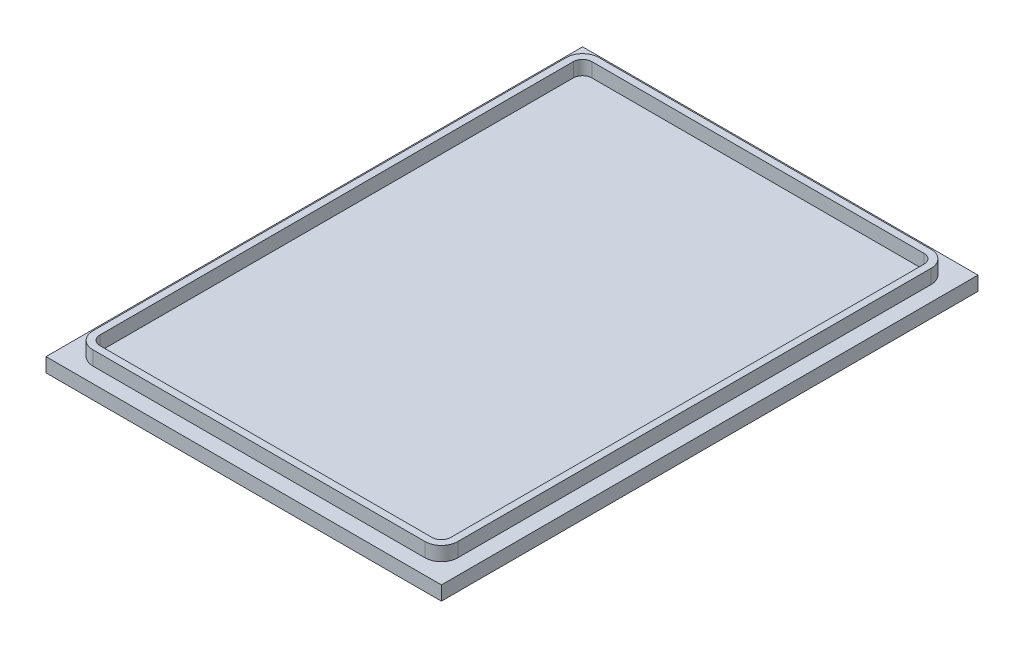
ISO-10303-21;
HEADER;
FILE_DESCRIPTION(('STEP AP214'),'2;1');
FILE_NAME('part.step','',(''),(''),'','','');
FILE_SCHEMA(('AUTOMOTIVE_DESIGN { 1 0 10303 214 1 1 1 1 }'));
ENDSEC;
DATA;
#1=APPLICATION_CONTEXT('core data for automotive mechanical design processes');
#2=APPLICATION_PROTOCOL_DEFINITION('international standard','automotive_design',2000,#1);
#3=PRODUCT_CONTEXT('',#1,'mechanical');
#4=PRODUCT('Part','Part','',(#3));
#5=PRODUCT_RELATED_PRODUCT_CATEGORY('part','',(#4));
#6=PRODUCT_DEFINITION_FORMATION('','',#4);
#7=PRODUCT_DEFINITION_CONTEXT('part definition',#1,'design');
#8=PRODUCT_DEFINITION('design','',#6,#7);
#9=PRODUCT_DEFINITION_SHAPE('','',#8);
#10=(LENGTH_UNIT() NAMED_UNIT(*) SI_UNIT(.MILLI.,.METRE.));
#11=(NAMED_UNIT(*) PLANE_ANGLE_UNIT() SI_UNIT($,.RADIAN.));
#12=(NAMED_UNIT(*) SI_UNIT($,.STERADIAN.) SOLID_ANGLE_UNIT());
#13=UNCERTAINTY_MEASURE_WITH_UNIT(LENGTH_MEASURE(1.E-05),#10,'distance_accuracy_value','');
#14=(GEOMETRIC_REPRESENTATION_CONTEXT(3) GLOBAL_UNCERTAINTY_ASSIGNED_CONTEXT((#13)) GLOBAL_UNIT_ASSIGNED_CONTEXT((#10,
#11,#12)) REPRESENTATION_CONTEXT('',''));
#15=CARTESIAN_POINT('',(0.,0.,0.));
#16=DIRECTION('',(0.,0.,1.));
#17=DIRECTION('',(1.,0.,0.));
#18=AXIS2_PLACEMENT_3D('',#15,#16,#17);
#19=CARTESIAN_POINT('',(0.,3.175,0.));
#20=DIRECTION('',(0.,1.,0.));
#21=DIRECTION('',(0.,0.,1.));
#22=AXIS2_PLACEMENT_3D('',#19,#20,#21);
#23=PLANE('',#22);
#24=DIRECTION('',(0.,0.,-1.));
#25=VECTOR('',#24,1.);
#26=CARTESIAN_POINT('',(44.45,3.175,-60.325));
#27=LINE('',#26,#25);
#28=CARTESIAN_POINT('',(44.45,3.175,60.325));
#29=VERTEX_POINT('',#28);
#30=CARTESIAN_POINT('',(44.45,3.175,-60.325));
#31=VERTEX_POINT('',#30);
#32=EDGE_CURVE('E297',#29,#31,#27,.T.);
#33=ORIENTED_EDGE('',*,*,#32,.T.);
#34=DIRECTION('',(-1.,0.,0.));
#35=VECTOR('',#34,1.);
#36=CARTESIAN_POINT('',(-44.45,3.175,-60.325));
#37=LINE('',#36,#35);
#38=CARTESIAN_POINT('',(-44.45,3.175,-60.325));
#39=VERTEX_POINT('',#38);
#40=EDGE_CURVE('E300',#31,#39,#37,.T.);
#41=ORIENTED_EDGE('',*,*,#40,.T.);
#42=DIRECTION('',(0.,0.,1.));
#43=VECTOR('',#42,1.);
#44=CARTESIAN_POINT('',(-44.45,3.175,-60.325));
#45=LINE('',#44,#43);
#46=CARTESIAN_POINT('',(-44.45,3.175,60.325));
#47=VERTEX_POINT('',#46);
#48=EDGE_CURVE('E303',#39,#47,#45,.T.);
#49=ORIENTED_EDGE('',*,*,#48,.T.);
#50=DIRECTION('',(1.,0.,0.));
#51=VECTOR('',#50,1.);
#52=CARTESIAN_POINT('',(-44.45,3.175,60.325));
#53=LINE('',#52,#51);
#54=EDGE_CURVE('E305',#47,#29,#53,.T.);
#55=ORIENTED_EDGE('',*,*,#54,.T.);
#56=EDGE_LOOP('',(#33,#41,#49,#55));
#57=FACE_BOUND('',#56,.T.);
#58=DIRECTION('',(1.,0.,0.));
#59=VECTOR('',#58,1.);
#60=CARTESIAN_POINT('',(-37.338,3.175,56.896));
#61=LINE('',#60,#59);
#62=CARTESIAN_POINT('',(-37.338,3.175,56.896));
#63=VERTEX_POINT('',#62);
#64=CARTESIAN_POINT('',(37.338,3.175,56.896));
#65=VERTEX_POINT('',#64);
#66=EDGE_CURVE('E263',#63,#65,#61,.T.);
#67=ORIENTED_EDGE('',*,*,#66,.F.);
#68=CARTESIAN_POINT('',(-37.338,3.175,53.213));
#69=DIRECTION('',(0.,1.,0.));
#70=DIRECTION('',(0.,0.,1.));
#71=AXIS2_PLACEMENT_3D('',#68,#69,#70);
#72=CIRCLE('',#71,3.683);
#73=CARTESIAN_POINT('',(-41.021,3.175,53.213));
#74=VERTEX_POINT('',#73);
#75=EDGE_CURVE('E230',#74,#63,#72,.T.);
#76=ORIENTED_EDGE('',*,*,#75,.F.);
#77=DIRECTION('',(0.,0.,1.));
#78=VECTOR('',#77,1.);
#79=CARTESIAN_POINT('',(-41.021,3.175,-53.213));
#80=LINE('',#79,#78);
#81=CARTESIAN_POINT('',(-41.021,3.175,-53.213));
#82=VERTEX_POINT('',#81);
#83=EDGE_CURVE('E246',#82,#74,#80,.T.);
#84=ORIENTED_EDGE('',*,*,#83,.F.);
#85=CARTESIAN_POINT('',(-37.338,3.175,-53.213));
#86=DIRECTION('',(0.,1.,0.));
#87=DIRECTION('',(0.,0.,1.));
#88=AXIS2_PLACEMENT_3D('',#85,#86,#87);
#89=CIRCLE('',#88,3.683);
#90=CARTESIAN_POINT('',(-37.338,3.175,-56.896));
#91=VERTEX_POINT('',#90);
#92=EDGE_CURVE('E273',#91,#82,#89,.T.);
#93=ORIENTED_EDGE('',*,*,#92,.F.);
#94=DIRECTION('',(-1.,0.,0.));
#95=VECTOR('',#94,1.);
#96=CARTESIAN_POINT('',(-37.338,3.175,-56.896));
#97=LINE('',#96,#95);
#98=CARTESIAN_POINT('',(37.338,3.175,-56.896));
#99=VERTEX_POINT('',#98);
#100=EDGE_CURVE('E271',#99,#91,#97,.T.);
#101=ORIENTED_EDGE('',*,*,#100,.F.);
#102=CARTESIAN_POINT('',(37.338,3.175,-53.213));
#103=DIRECTION('',(0.,1.,0.));
#104=DIRECTION('',(0.,0.,-1.));
#105=AXIS2_PLACEMENT_3D('',#102,#103,#104);
#106=CIRCLE('',#105,3.683);
#107=CARTESIAN_POINT('',(41.021,3.175,-53.213));
#108=VERTEX_POINT('',#107);
#109=EDGE_CURVE('E269',#108,#99,#106,.T.);
#110=ORIENTED_EDGE('',*,*,#109,.F.);
#111=DIRECTION('',(0.,0.,-1.));
#112=VECTOR('',#111,1.);
#113=CARTESIAN_POINT('',(41.021,3.175,-53.213));
#114=LINE('',#113,#112);
#115=CARTESIAN_POINT('',(41.021,3.175,53.213));
#116=VERTEX_POINT('',#115);
#117=EDGE_CURVE('E267',#116,#108,#114,.T.);
#118=ORIENTED_EDGE('',*,*,#117,.F.);
#119=CARTESIAN_POINT('',(37.338,3.175,53.213));
#120=DIRECTION('',(0.,1.,0.));
#121=DIRECTION('',(0.,0.,1.));
#122=AXIS2_PLACEMENT_3D('',#119,#120,#121);
#123=CIRCLE('',#122,3.683);
#124=EDGE_CURVE('E265',#65,#116,#123,.T.);
#125=ORIENTED_EDGE('',*,*,#124,.F.);
#126=EDGE_LOOP('',(#67,#76,#84,#93,#101,#110,#118,#125));
#127=FACE_BOUND('',#126,.T.);
#128=ADVANCED_FACE('F33',(#57,#127),#23,.T.);
#129=CARTESIAN_POINT('',(44.45,3.175,-60.325));
#130=DIRECTION('',(-1.,0.,0.));
#131=DIRECTION('',(0.,0.,1.));
#132=AXIS2_PLACEMENT_3D('',#129,#130,#131);
#133=PLANE('',#132);
#134=DIRECTION('',(0.,0.,-1.));
#135=VECTOR('',#134,1.);
#136=CARTESIAN_POINT('',(44.45,0.,-60.325));
#137=LINE('',#136,#135);
#138=CARTESIAN_POINT('',(44.45,0.,60.325));
#139=VERTEX_POINT('',#138);
#140=CARTESIAN_POINT('',(44.45,0.,-60.325));
#141=VERTEX_POINT('',#140);
#142=EDGE_CURVE('E296',#139,#141,#137,.T.);
#143=ORIENTED_EDGE('',*,*,#142,.T.);
#144=DIRECTION('',(0.,-1.,0.));
#145=VECTOR('',#144,1.);
#146=CARTESIAN_POINT('',(44.45,3.175,-60.325));
#147=LINE('',#146,#145);
#148=EDGE_CURVE('E11',#31,#141,#147,.T.);
#149=ORIENTED_EDGE('',*,*,#148,.F.);
#150=ORIENTED_EDGE('',*,*,#32,.F.);
#151=DIRECTION('',(0.,-1.,0.));
#152=VECTOR('',#151,1.);
#153=CARTESIAN_POINT('',(44.45,3.175,60.325));
#154=LINE('',#153,#152);
#155=EDGE_CURVE('E307',#29,#139,#154,.T.);
#156=ORIENTED_EDGE('',*,*,#155,.T.);
#157=EDGE_LOOP('',(#143,#149,#150,#156));
#158=FACE_BOUND('',#157,.T.);
#159=ADVANCED_FACE('F35',(#158),#133,.F.);
#160=CARTESIAN_POINT('',(-44.45,3.175,-60.325));
#161=DIRECTION('',(0.,0.,1.));
#162=DIRECTION('',(1.,0.,0.));
#163=AXIS2_PLACEMENT_3D('',#160,#161,#162);
#164=PLANE('',#163);
#165=DIRECTION('',(-1.,0.,0.));
#166=VECTOR('',#165,1.);
#167=CARTESIAN_POINT('',(-44.45,0.,-60.325));
#168=LINE('',#167,#166);
#169=CARTESIAN_POINT('',(-44.45,0.,-60.325));
#170=VERTEX_POINT('',#169);
#171=EDGE_CURVE('E310',#141,#170,#168,.T.);
#172=ORIENTED_EDGE('',*,*,#171,.T.);
#173=DIRECTION('',(0.,-1.,0.));
#174=VECTOR('',#173,1.);
#175=CARTESIAN_POINT('',(-44.45,3.175,-60.325));
#176=LINE('',#175,#174);
#177=EDGE_CURVE('E41',#39,#170,#176,.T.);
#178=ORIENTED_EDGE('',*,*,#177,.F.);
#179=ORIENTED_EDGE('',*,*,#40,.F.);
#180=ORIENTED_EDGE('',*,*,#148,.T.);
#181=EDGE_LOOP('',(#172,#178,#179,#180));
#182=FACE_BOUND('',#181,.T.);
#183=ADVANCED_FACE('F340',(#182),#164,.F.);
#184=CARTESIAN_POINT('',(-44.45,3.175,-60.325));
#185=DIRECTION('',(1.,0.,0.));
#186=DIRECTION('',(0.,0.,-1.));
#187=AXIS2_PLACEMENT_3D('',#184,#185,#186);
#188=PLANE('',#187);
#189=DIRECTION('',(0.,0.,1.));
#190=VECTOR('',#189,1.);
#191=CARTESIAN_POINT('',(-44.45,0.,-60.325));
#192=LINE('',#191,#190);
#193=CARTESIAN_POINT('',(-44.45,0.,60.325));
#194=VERTEX_POINT('',#193);
#195=EDGE_CURVE('E312',#170,#194,#192,.T.);
#196=ORIENTED_EDGE('',*,*,#195,.T.);
#197=DIRECTION('',(0.,-1.,0.));
#198=VECTOR('',#197,1.);
#199=CARTESIAN_POINT('',(-44.45,3.175,60.325));
#200=LINE('',#199,#198);
#201=EDGE_CURVE('E317',#47,#194,#200,.T.);
#202=ORIENTED_EDGE('',*,*,#201,.F.);
#203=ORIENTED_EDGE('',*,*,#48,.F.);
#204=ORIENTED_EDGE('',*,*,#177,.T.);
#205=EDGE_LOOP('',(#196,#202,#203,#204));
#206=FACE_BOUND('',#205,.T.);
#207=ADVANCED_FACE('F324',(#206),#188,.F.);
#208=CARTESIAN_POINT('',(-44.45,3.175,60.325));
#209=DIRECTION('',(0.,0.,-1.));
#210=DIRECTION('',(-1.,0.,0.));
#211=AXIS2_PLACEMENT_3D('',#208,#209,#210);
#212=PLANE('',#211);
#213=DIRECTION('',(1.,0.,0.));
#214=VECTOR('',#213,1.);
#215=CARTESIAN_POINT('',(-44.45,0.,60.325));
#216=LINE('',#215,#214);
#217=EDGE_CURVE('E301',#194,#139,#216,.T.);
#218=ORIENTED_EDGE('',*,*,#217,.T.);
#219=ORIENTED_EDGE('',*,*,#155,.F.);
#220=ORIENTED_EDGE('',*,*,#54,.F.);
#221=ORIENTED_EDGE('',*,*,#201,.T.);
#222=EDGE_LOOP('',(#218,#219,#220,#221));
#223=FACE_BOUND('',#222,.T.);
#224=ADVANCED_FACE('F333',(#223),#212,.F.);
#225=CARTESIAN_POINT('',(0.,0.,0.));
#226=DIRECTION('',(0.,1.,0.));
#227=DIRECTION('',(0.,0.,1.));
#228=AXIS2_PLACEMENT_3D('',#225,#226,#227);
#229=PLANE('',#228);
#230=ORIENTED_EDGE('',*,*,#142,.F.);
#231=ORIENTED_EDGE('',*,*,#217,.F.);
#232=ORIENTED_EDGE('',*,*,#195,.F.);
#233=ORIENTED_EDGE('',*,*,#171,.F.);
#234=EDGE_LOOP('',(#230,#231,#232,#233));
#235=FACE_BOUND('',#234,.T.);
#236=ADVANCED_FACE('F330',(#235),#229,.F.);
#237=CARTESIAN_POINT('',(-37.338,6.35,53.213));
#238=DIRECTION('',(0.,-1.,0.));
#239=DIRECTION('',(0.,0.,-1.));
#240=AXIS2_PLACEMENT_3D('',#237,#238,#239);
#241=CYLINDRICAL_SURFACE('',#240,3.683);
#242=ORIENTED_EDGE('',*,*,#75,.T.);
#243=DIRECTION('',(0.,-1.,0.));
#244=VECTOR('',#243,1.);
#245=CARTESIAN_POINT('',(-37.338,6.35,56.896));
#246=LINE('',#245,#244);
#247=CARTESIAN_POINT('',(-37.338,6.35,56.896));
#248=VERTEX_POINT('',#247);
#249=EDGE_CURVE('E294',#248,#63,#246,.T.);
#250=ORIENTED_EDGE('',*,*,#249,.F.);
#251=CARTESIAN_POINT('',(-37.338,6.35,53.213));
#252=DIRECTION('',(0.,1.,0.));
#253=DIRECTION('',(0.,0.,1.));
#254=AXIS2_PLACEMENT_3D('',#251,#252,#253);
#255=CIRCLE('',#254,3.683);
#256=CARTESIAN_POINT('',(-41.021,6.35,53.213));
#257=VERTEX_POINT('',#256);
#258=EDGE_CURVE('E242',#257,#248,#255,.T.);
#259=ORIENTED_EDGE('',*,*,#258,.F.);
#260=DIRECTION('',(0.,-1.,0.));
#261=VECTOR('',#260,1.);
#262=CARTESIAN_POINT('',(-41.021,6.35,53.213));
#263=LINE('',#262,#261);
#264=EDGE_CURVE('E260',#257,#74,#263,.T.);
#265=ORIENTED_EDGE('',*,*,#264,.T.);
#266=EDGE_LOOP('',(#242,#250,#259,#265));
#267=FACE_BOUND('',#266,.T.);
#268=ADVANCED_FACE('F353',(#267),#241,.T.);
#269=CARTESIAN_POINT('',(-37.338,6.35,56.896));
#270=DIRECTION('',(0.,0.,-1.));
#271=DIRECTION('',(-1.,0.,0.));
#272=AXIS2_PLACEMENT_3D('',#269,#270,#271);
#273=PLANE('',#272);
#274=ORIENTED_EDGE('',*,*,#66,.T.);
#275=DIRECTION('',(0.,-1.,0.));
#276=VECTOR('',#275,1.);
#277=CARTESIAN_POINT('',(37.338,6.35,56.896));
#278=LINE('',#277,#276);
#279=CARTESIAN_POINT('',(37.338,6.35,56.896));
#280=VERTEX_POINT('',#279);
#281=EDGE_CURVE('E291',#280,#65,#278,.T.);
#282=ORIENTED_EDGE('',*,*,#281,.F.);
#283=DIRECTION('',(1.,0.,0.));
#284=VECTOR('',#283,1.);
#285=CARTESIAN_POINT('',(-37.338,6.35,56.896));
#286=LINE('',#285,#284);
#287=EDGE_CURVE('E245',#248,#280,#286,.T.);
#288=ORIENTED_EDGE('',*,*,#287,.F.);
#289=ORIENTED_EDGE('',*,*,#249,.T.);
#290=EDGE_LOOP('',(#274,#282,#288,#289));
#291=FACE_BOUND('',#290,.T.);
#292=ADVANCED_FACE('F372',(#291),#273,.F.);
#293=CARTESIAN_POINT('',(37.338,6.35,53.213));
#294=DIRECTION('',(0.,-1.,0.));
#295=DIRECTION('',(0.,0.,-1.));
#296=AXIS2_PLACEMENT_3D('',#293,#294,#295);
#297=CYLINDRICAL_SURFACE('',#296,3.683);
#298=ORIENTED_EDGE('',*,*,#124,.T.);
#299=DIRECTION('',(0.,-1.,0.));
#300=VECTOR('',#299,1.);
#301=CARTESIAN_POINT('',(41.021,6.35,53.213));
#302=LINE('',#301,#300);
#303=CARTESIAN_POINT('',(41.021,6.35,53.213));
#304=VERTEX_POINT('',#303);
#305=EDGE_CURVE('E288',#304,#116,#302,.T.);
#306=ORIENTED_EDGE('',*,*,#305,.F.);
#307=CARTESIAN_POINT('',(37.338,6.35,53.213));
#308=DIRECTION('',(0.,1.,0.));
#309=DIRECTION('',(0.,0.,1.));
#310=AXIS2_PLACEMENT_3D('',#307,#308,#309);
#311=CIRCLE('',#310,3.683);
#312=EDGE_CURVE('E248',#280,#304,#311,.T.);
#313=ORIENTED_EDGE('',*,*,#312,.F.);
#314=ORIENTED_EDGE('',*,*,#281,.T.);
#315=EDGE_LOOP('',(#298,#306,#313,#314));
#316=FACE_BOUND('',#315,.T.);
#317=ADVANCED_FACE('F379',(#316),#297,.T.);
#318=CARTESIAN_POINT('',(41.021,6.35,-53.213));
#319=DIRECTION('',(-1.,0.,0.));
#320=DIRECTION('',(0.,0.,1.));
#321=AXIS2_PLACEMENT_3D('',#318,#319,#320);
#322=PLANE('',#321);
#323=ORIENTED_EDGE('',*,*,#117,.T.);
#324=DIRECTION('',(0.,-1.,0.));
#325=VECTOR('',#324,1.);
#326=CARTESIAN_POINT('',(41.021,6.35,-53.213));
#327=LINE('',#326,#325);
#328=CARTESIAN_POINT('',(41.021,6.35,-53.213));
#329=VERTEX_POINT('',#328);
#330=EDGE_CURVE('E285',#329,#108,#327,.T.);
#331=ORIENTED_EDGE('',*,*,#330,.F.);
#332=DIRECTION('',(0.,0.,-1.));
#333=VECTOR('',#332,1.);
#334=CARTESIAN_POINT('',(41.021,6.35,-53.213));
#335=LINE('',#334,#333);
#336=EDGE_CURVE('E250',#304,#329,#335,.T.);
#337=ORIENTED_EDGE('',*,*,#336,.F.);
#338=ORIENTED_EDGE('',*,*,#305,.T.);
#339=EDGE_LOOP('',(#323,#331,#337,#338));
#340=FACE_BOUND('',#339,.T.);
#341=ADVANCED_FACE('F386',(#340),#322,.F.);
#342=CARTESIAN_POINT('',(37.338,6.35,-53.213));
#343=DIRECTION('',(0.,-1.,0.));
#344=DIRECTION('',(0.,0.,-1.));
#345=AXIS2_PLACEMENT_3D('',#342,#343,#344);
#346=CYLINDRICAL_SURFACE('',#345,3.683);
#347=ORIENTED_EDGE('',*,*,#109,.T.);
#348=DIRECTION('',(0.,-1.,0.));
#349=VECTOR('',#348,1.);
#350=CARTESIAN_POINT('',(37.338,6.35,-56.896));
#351=LINE('',#350,#349);
#352=CARTESIAN_POINT('',(37.338,6.35,-56.896));
#353=VERTEX_POINT('',#352);
#354=EDGE_CURVE('E282',#353,#99,#351,.T.);
#355=ORIENTED_EDGE('',*,*,#354,.F.);
#356=CARTESIAN_POINT('',(37.338,6.35,-53.213));
#357=DIRECTION('',(0.,1.,0.));
#358=DIRECTION('',(0.,0.,-1.));
#359=AXIS2_PLACEMENT_3D('',#356,#357,#358);
#360=CIRCLE('',#359,3.683);
#361=EDGE_CURVE('E252',#329,#353,#360,.T.);
#362=ORIENTED_EDGE('',*,*,#361,.F.);
#363=ORIENTED_EDGE('',*,*,#330,.T.);
#364=EDGE_LOOP('',(#347,#355,#362,#363));
#365=FACE_BOUND('',#364,.T.);
#366=ADVANCED_FACE('F394',(#365),#346,.T.);
#367=CARTESIAN_POINT('',(-37.338,6.35,-56.896));
#368=DIRECTION('',(0.,0.,1.));
#369=DIRECTION('',(1.,0.,0.));
#370=AXIS2_PLACEMENT_3D('',#367,#368,#369);
#371=PLANE('',#370);
#372=ORIENTED_EDGE('',*,*,#100,.T.);
#373=DIRECTION('',(0.,-1.,0.));
#374=VECTOR('',#373,1.);
#375=CARTESIAN_POINT('',(-37.338,6.35,-56.896));
#376=LINE('',#375,#374);
#377=CARTESIAN_POINT('',(-37.338,6.35,-56.896));
#378=VERTEX_POINT('',#377);
#379=EDGE_CURVE('E279',#378,#91,#376,.T.);
#380=ORIENTED_EDGE('',*,*,#379,.F.);
#381=DIRECTION('',(-1.,0.,0.));
#382=VECTOR('',#381,1.);
#383=CARTESIAN_POINT('',(-37.338,6.35,-56.896));
#384=LINE('',#383,#382);
#385=EDGE_CURVE('E254',#353,#378,#384,.T.);
#386=ORIENTED_EDGE('',*,*,#385,.F.);
#387=ORIENTED_EDGE('',*,*,#354,.T.);
#388=EDGE_LOOP('',(#372,#380,#386,#387));
#389=FACE_BOUND('',#388,.T.);
#390=ADVANCED_FACE('F402',(#389),#371,.F.);
#391=CARTESIAN_POINT('',(-37.338,6.35,-53.213));
#392=DIRECTION('',(0.,-1.,0.));
#393=DIRECTION('',(0.,0.,-1.));
#394=AXIS2_PLACEMENT_3D('',#391,#392,#393);
#395=CYLINDRICAL_SURFACE('',#394,3.683);
#396=ORIENTED_EDGE('',*,*,#92,.T.);
#397=DIRECTION('',(0.,-1.,0.));
#398=VECTOR('',#397,1.);
#399=CARTESIAN_POINT('',(-41.021,6.35,-53.213));
#400=LINE('',#399,#398);
#401=CARTESIAN_POINT('',(-41.021,6.35,-53.213));
#402=VERTEX_POINT('',#401);
#403=EDGE_CURVE('E56',#402,#82,#400,.T.);
#404=ORIENTED_EDGE('',*,*,#403,.F.);
#405=CARTESIAN_POINT('',(-37.338,6.35,-53.213));
#406=DIRECTION('',(0.,1.,0.));
#407=DIRECTION('',(0.,0.,1.));
#408=AXIS2_PLACEMENT_3D('',#405,#406,#407);
#409=CIRCLE('',#408,3.683);
#410=EDGE_CURVE('E256',#378,#402,#409,.T.);
#411=ORIENTED_EDGE('',*,*,#410,.F.);
#412=ORIENTED_EDGE('',*,*,#379,.T.);
#413=EDGE_LOOP('',(#396,#404,#411,#412));
#414=FACE_BOUND('',#413,.T.);
#415=ADVANCED_FACE('F410',(#414),#395,.T.);
#416=CARTESIAN_POINT('',(-41.021,6.35,-53.213));
#417=DIRECTION('',(1.,0.,0.));
#418=DIRECTION('',(0.,0.,-1.));
#419=AXIS2_PLACEMENT_3D('',#416,#417,#418);
#420=PLANE('',#419);
#421=ORIENTED_EDGE('',*,*,#83,.T.);
#422=ORIENTED_EDGE('',*,*,#264,.F.);
#423=DIRECTION('',(0.,0.,1.));
#424=VECTOR('',#423,1.);
#425=CARTESIAN_POINT('',(-41.021,6.35,-53.213));
#426=LINE('',#425,#424);
#427=EDGE_CURVE('E258',#402,#257,#426,.T.);
#428=ORIENTED_EDGE('',*,*,#427,.F.);
#429=ORIENTED_EDGE('',*,*,#403,.T.);
#430=EDGE_LOOP('',(#421,#422,#428,#429));
#431=FACE_BOUND('',#430,.T.);
#432=ADVANCED_FACE('F418',(#431),#420,.F.);
#433=CARTESIAN_POINT('',(-37.338,6.35,53.213));
#434=DIRECTION('',(0.,1.,0.));
#435=DIRECTION('',(0.,0.,1.));
#436=AXIS2_PLACEMENT_3D('',#433,#434,#435);
#437=PLANE('',#436);
#438=CARTESIAN_POINT('',(-37.338,6.35,53.213));
#439=DIRECTION('',(0.,1.,0.));
#440=DIRECTION('',(0.,0.,1.));
#441=AXIS2_PLACEMENT_3D('',#438,#439,#440);
#442=CIRCLE('',#441,2.0955);
#443=CARTESIAN_POINT('',(-39.4335,6.35,53.213));
#444=VERTEX_POINT('',#443);
#445=CARTESIAN_POINT('',(-37.338,6.35,55.3085));
#446=VERTEX_POINT('',#445);
#447=EDGE_CURVE('E48',#444,#446,#442,.T.);
#448=ORIENTED_EDGE('',*,*,#447,.F.);
#449=DIRECTION('',(0.,0.,1.));
#450=VECTOR('',#449,1.);
#451=CARTESIAN_POINT('',(-39.4335,6.35,-53.213));
#452=LINE('',#451,#450);
#453=CARTESIAN_POINT('',(-39.4335,6.35,-53.213));
#454=VERTEX_POINT('',#453);
#455=EDGE_CURVE('E192',#454,#444,#452,.T.);
#456=ORIENTED_EDGE('',*,*,#455,.F.);
#457=CARTESIAN_POINT('',(-37.338,6.35,-53.213));
#458=DIRECTION('',(0.,1.,0.));
#459=DIRECTION('',(0.,0.,1.));
#460=AXIS2_PLACEMENT_3D('',#457,#458,#459);
#461=CIRCLE('',#460,2.0955);
#462=CARTESIAN_POINT('',(-37.338,6.35,-55.3085));
#463=VERTEX_POINT('',#462);
#464=EDGE_CURVE('E195',#463,#454,#461,.T.);
#465=ORIENTED_EDGE('',*,*,#464,.F.);
#466=DIRECTION('',(-1.,0.,0.));
#467=VECTOR('',#466,1.);
#468=CARTESIAN_POINT('',(37.338,6.35,-55.3085));
#469=LINE('',#468,#467);
#470=CARTESIAN_POINT('',(37.338,6.35,-55.3085));
#471=VERTEX_POINT('',#470);
#472=EDGE_CURVE('E223',#471,#463,#469,.T.);
#473=ORIENTED_EDGE('',*,*,#472,.F.);
#474=CARTESIAN_POINT('',(37.338,6.35,-53.213));
#475=DIRECTION('',(0.,1.,0.));
#476=DIRECTION('',(0.,0.,1.));
#477=AXIS2_PLACEMENT_3D('',#474,#475,#476);
#478=CIRCLE('',#477,2.0955);
#479=CARTESIAN_POINT('',(39.4335,6.35,-53.213));
#480=VERTEX_POINT('',#479);
#481=EDGE_CURVE('E220',#480,#471,#478,.T.);
#482=ORIENTED_EDGE('',*,*,#481,.F.);
#483=DIRECTION('',(0.,0.,-1.));
#484=VECTOR('',#483,1.);
#485=CARTESIAN_POINT('',(39.4335,6.35,53.213));
#486=LINE('',#485,#484);
#487=CARTESIAN_POINT('',(39.4335,6.35,53.213));
#488=VERTEX_POINT('',#487);
#489=EDGE_CURVE('E217',#488,#480,#486,.T.);
#490=ORIENTED_EDGE('',*,*,#489,.F.);
#491=CARTESIAN_POINT('',(37.338,6.35,53.213));
#492=DIRECTION('',(0.,1.,0.));
#493=DIRECTION('',(0.,0.,1.));
#494=AXIS2_PLACEMENT_3D('',#491,#492,#493);
#495=CIRCLE('',#494,2.0955);
#496=CARTESIAN_POINT('',(37.338,6.35,55.3085));
#497=VERTEX_POINT('',#496);
#498=EDGE_CURVE('E214',#497,#488,#495,.T.);
#499=ORIENTED_EDGE('',*,*,#498,.F.);
#500=DIRECTION('',(1.,0.,0.));
#501=VECTOR('',#500,1.);
#502=CARTESIAN_POINT('',(-37.338,6.35,55.3085));
#503=LINE('',#502,#501);
#504=EDGE_CURVE('E212',#446,#497,#503,.T.);
#505=ORIENTED_EDGE('',*,*,#504,.F.);
#506=EDGE_LOOP('',(#448,#456,#465,#473,#482,#490,#499,#505));
#507=FACE_BOUND('',#506,.T.);
#508=ORIENTED_EDGE('',*,*,#258,.T.);
#509=ORIENTED_EDGE('',*,*,#287,.T.);
#510=ORIENTED_EDGE('',*,*,#312,.T.);
#511=ORIENTED_EDGE('',*,*,#336,.T.);
#512=ORIENTED_EDGE('',*,*,#361,.T.);
#513=ORIENTED_EDGE('',*,*,#385,.T.);
#514=ORIENTED_EDGE('',*,*,#410,.T.);
#515=ORIENTED_EDGE('',*,*,#427,.T.);
#516=EDGE_LOOP('',(#508,#509,#510,#511,#512,#513,#514,#515));
#517=FACE_BOUND('',#516,.T.);
#518=ADVANCED_FACE('F426',(#507,#517),#437,.T.);
#519=CARTESIAN_POINT('',(-37.338,3.175,53.213));
#520=DIRECTION('',(0.,1.,0.));
#521=DIRECTION('',(0.,0.,1.));
#522=AXIS2_PLACEMENT_3D('',#519,#520,#521);
#523=CYLINDRICAL_SURFACE('',#522,2.0955);
#524=ORIENTED_EDGE('',*,*,#447,.T.);
#525=DIRECTION('',(0.,1.,0.));
#526=VECTOR('',#525,1.);
#527=CARTESIAN_POINT('',(-37.338,3.175,55.3085));
#528=LINE('',#527,#526);
#529=CARTESIAN_POINT('',(-37.338,3.175,55.3085));
#530=VERTEX_POINT('',#529);
#531=EDGE_CURVE('E169',#530,#446,#528,.T.);
#532=ORIENTED_EDGE('',*,*,#531,.F.);
#533=CARTESIAN_POINT('',(-37.338,3.175,53.213));
#534=DIRECTION('',(0.,1.,0.));
#535=DIRECTION('',(0.,0.,1.));
#536=AXIS2_PLACEMENT_3D('',#533,#534,#535);
#537=CIRCLE('',#536,2.0955);
#538=CARTESIAN_POINT('',(-39.4335,3.175,53.213));
#539=VERTEX_POINT('',#538);
#540=EDGE_CURVE('E173',#539,#530,#537,.T.);
#541=ORIENTED_EDGE('',*,*,#540,.F.);
#542=DIRECTION('',(0.,1.,0.));
#543=VECTOR('',#542,1.);
#544=CARTESIAN_POINT('',(-39.4335,3.175,53.213));
#545=LINE('',#544,#543);
#546=EDGE_CURVE('E228',#539,#444,#545,.T.);
#547=ORIENTED_EDGE('',*,*,#546,.T.);
#548=EDGE_LOOP('',(#524,#532,#541,#547));
#549=FACE_BOUND('',#548,.T.);
#550=ADVANCED_FACE('F171',(#549),#523,.F.);
#551=CARTESIAN_POINT('',(-39.4335,3.175,-53.213));
#552=DIRECTION('',(-1.,0.,0.));
#553=DIRECTION('',(0.,0.,1.));
#554=AXIS2_PLACEMENT_3D('',#551,#552,#553);
#555=PLANE('',#554);
#556=ORIENTED_EDGE('',*,*,#455,.T.);
#557=ORIENTED_EDGE('',*,*,#546,.F.);
#558=DIRECTION('',(0.,0.,1.));
#559=VECTOR('',#558,1.);
#560=CARTESIAN_POINT('',(-39.4335,3.175,-53.213));
#561=LINE('',#560,#559);
#562=CARTESIAN_POINT('',(-39.4335,3.175,-53.213));
#563=VERTEX_POINT('',#562);
#564=EDGE_CURVE('E179',#563,#539,#561,.T.);
#565=ORIENTED_EDGE('',*,*,#564,.F.);
#566=DIRECTION('',(0.,1.,0.));
#567=VECTOR('',#566,1.);
#568=CARTESIAN_POINT('',(-39.4335,3.175,-53.213));
#569=LINE('',#568,#567);
#570=EDGE_CURVE('E231',#563,#454,#569,.T.);
#571=ORIENTED_EDGE('',*,*,#570,.T.);
#572=EDGE_LOOP('',(#556,#557,#565,#571));
#573=FACE_BOUND('',#572,.T.);
#574=ADVANCED_FACE('F440',(#573),#555,.F.);
#575=CARTESIAN_POINT('',(-37.338,3.175,-53.213));
#576=DIRECTION('',(0.,1.,0.));
#577=DIRECTION('',(0.,0.,1.));
#578=AXIS2_PLACEMENT_3D('',#575,#576,#577);
#579=CYLINDRICAL_SURFACE('',#578,2.0955);
#580=ORIENTED_EDGE('',*,*,#464,.T.);
#581=ORIENTED_EDGE('',*,*,#570,.F.);
#582=CARTESIAN_POINT('',(-37.338,3.175,-53.213));
#583=DIRECTION('',(0.,1.,0.));
#584=DIRECTION('',(0.,0.,1.));
#585=AXIS2_PLACEMENT_3D('',#582,#583,#584);
#586=CIRCLE('',#585,2.0955);
#587=CARTESIAN_POINT('',(-37.338,3.175,-55.3085));
#588=VERTEX_POINT('',#587);
#589=EDGE_CURVE('E208',#588,#563,#586,.T.);
#590=ORIENTED_EDGE('',*,*,#589,.F.);
#591=DIRECTION('',(0.,1.,0.));
#592=VECTOR('',#591,1.);
#593=CARTESIAN_POINT('',(-37.338,3.175,-55.3085));
#594=LINE('',#593,#592);
#595=EDGE_CURVE('E233',#588,#463,#594,.T.);
#596=ORIENTED_EDGE('',*,*,#595,.T.);
#597=EDGE_LOOP('',(#580,#581,#590,#596));
#598=FACE_BOUND('',#597,.T.);
#599=ADVANCED_FACE('F447',(#598),#579,.F.);
#600=CARTESIAN_POINT('',(37.338,3.175,-55.3085));
#601=DIRECTION('',(0.,0.,-1.));
#602=DIRECTION('',(-1.,0.,0.));
#603=AXIS2_PLACEMENT_3D('',#600,#601,#602);
#604=PLANE('',#603);
#605=ORIENTED_EDGE('',*,*,#472,.T.);
#606=ORIENTED_EDGE('',*,*,#595,.F.);
#607=DIRECTION('',(-1.,0.,0.));
#608=VECTOR('',#607,1.);
#609=CARTESIAN_POINT('',(37.338,3.175,-55.3085));
#610=LINE('',#609,#608);
#611=CARTESIAN_POINT('',(37.338,3.175,-55.3085));
#612=VERTEX_POINT('',#611);
#613=EDGE_CURVE('E205',#612,#588,#610,.T.);
#614=ORIENTED_EDGE('',*,*,#613,.F.);
#615=DIRECTION('',(0.,1.,0.));
#616=VECTOR('',#615,1.);
#617=CARTESIAN_POINT('',(37.338,3.175,-55.3085));
#618=LINE('',#617,#616);
#619=EDGE_CURVE('E235',#612,#471,#618,.T.);
#620=ORIENTED_EDGE('',*,*,#619,.T.);
#621=EDGE_LOOP('',(#605,#606,#614,#620));
#622=FACE_BOUND('',#621,.T.);
#623=ADVANCED_FACE('F455',(#622),#604,.F.);
#624=CARTESIAN_POINT('',(37.338,3.175,-53.213));
#625=DIRECTION('',(0.,1.,0.));
#626=DIRECTION('',(0.,0.,1.));
#627=AXIS2_PLACEMENT_3D('',#624,#625,#626);
#628=CYLINDRICAL_SURFACE('',#627,2.0955);
#629=ORIENTED_EDGE('',*,*,#481,.T.);
#630=ORIENTED_EDGE('',*,*,#619,.F.);
#631=CARTESIAN_POINT('',(37.338,3.175,-53.213));
#632=DIRECTION('',(0.,1.,0.));
#633=DIRECTION('',(0.,0.,1.));
#634=AXIS2_PLACEMENT_3D('',#631,#632,#633);
#635=CIRCLE('',#634,2.0955);
#636=CARTESIAN_POINT('',(39.4335,3.175,-53.213));
#637=VERTEX_POINT('',#636);
#638=EDGE_CURVE('E202',#637,#612,#635,.T.);
#639=ORIENTED_EDGE('',*,*,#638,.F.);
#640=DIRECTION('',(0.,1.,0.));
#641=VECTOR('',#640,1.);
#642=CARTESIAN_POINT('',(39.4335,3.175,-53.213));
#643=LINE('',#642,#641);
#644=EDGE_CURVE('E237',#637,#480,#643,.T.);
#645=ORIENTED_EDGE('',*,*,#644,.T.);
#646=EDGE_LOOP('',(#629,#630,#639,#645));
#647=FACE_BOUND('',#646,.T.);
#648=ADVANCED_FACE('F463',(#647),#628,.F.);
#649=CARTESIAN_POINT('',(39.4335,3.175,53.213));
#650=DIRECTION('',(1.,0.,0.));
#651=DIRECTION('',(0.,0.,-1.));
#652=AXIS2_PLACEMENT_3D('',#649,#650,#651);
#653=PLANE('',#652);
#654=ORIENTED_EDGE('',*,*,#489,.T.);
#655=ORIENTED_EDGE('',*,*,#644,.F.);
#656=DIRECTION('',(0.,0.,-1.));
#657=VECTOR('',#656,1.);
#658=CARTESIAN_POINT('',(39.4335,3.175,53.213));
#659=LINE('',#658,#657);
#660=CARTESIAN_POINT('',(39.4335,3.175,53.213));
#661=VERTEX_POINT('',#660);
#662=EDGE_CURVE('E199',#661,#637,#659,.T.);
#663=ORIENTED_EDGE('',*,*,#662,.F.);
#664=DIRECTION('',(0.,1.,0.));
#665=VECTOR('',#664,1.);
#666=CARTESIAN_POINT('',(39.4335,3.175,53.213));
#667=LINE('',#666,#665);
#668=EDGE_CURVE('E239',#661,#488,#667,.T.);
#669=ORIENTED_EDGE('',*,*,#668,.T.);
#670=EDGE_LOOP('',(#654,#655,#663,#669));
#671=FACE_BOUND('',#670,.T.);
#672=ADVANCED_FACE('F471',(#671),#653,.F.);
#673=CARTESIAN_POINT('',(37.338,3.175,53.213));
#674=DIRECTION('',(0.,1.,0.));
#675=DIRECTION('',(0.,0.,1.));
#676=AXIS2_PLACEMENT_3D('',#673,#674,#675);
#677=CYLINDRICAL_SURFACE('',#676,2.0955);
#678=ORIENTED_EDGE('',*,*,#498,.T.);
#679=ORIENTED_EDGE('',*,*,#668,.F.);
#680=CARTESIAN_POINT('',(37.338,3.175,53.213));
#681=DIRECTION('',(0.,1.,0.));
#682=DIRECTION('',(0.,0.,1.));
#683=AXIS2_PLACEMENT_3D('',#680,#681,#682);
#684=CIRCLE('',#683,2.0955);
#685=CARTESIAN_POINT('',(37.338,3.175,55.3085));
#686=VERTEX_POINT('',#685);
#687=EDGE_CURVE('E187',#686,#661,#684,.T.);
#688=ORIENTED_EDGE('',*,*,#687,.F.);
#689=DIRECTION('',(0.,1.,0.));
#690=VECTOR('',#689,1.);
#691=CARTESIAN_POINT('',(37.338,3.175,55.3085));
#692=LINE('',#691,#690);
#693=EDGE_CURVE('E178',#686,#497,#692,.T.);
#694=ORIENTED_EDGE('',*,*,#693,.T.);
#695=EDGE_LOOP('',(#678,#679,#688,#694));
#696=FACE_BOUND('',#695,.T.);
#697=ADVANCED_FACE('F479',(#696),#677,.F.);
#698=CARTESIAN_POINT('',(-37.338,3.175,55.3085));
#699=DIRECTION('',(0.,0.,1.));
#700=DIRECTION('',(1.,0.,0.));
#701=AXIS2_PLACEMENT_3D('',#698,#699,#700);
#702=PLANE('',#701);
#703=ORIENTED_EDGE('',*,*,#504,.T.);
#704=ORIENTED_EDGE('',*,*,#693,.F.);
#705=DIRECTION('',(1.,0.,0.));
#706=VECTOR('',#705,1.);
#707=CARTESIAN_POINT('',(-37.338,3.175,55.3085));
#708=LINE('',#707,#706);
#709=EDGE_CURVE('E182',#530,#686,#708,.T.);
#710=ORIENTED_EDGE('',*,*,#709,.F.);
#711=ORIENTED_EDGE('',*,*,#531,.T.);
#712=EDGE_LOOP('',(#703,#704,#710,#711));
#713=FACE_BOUND('',#712,.T.);
#714=ADVANCED_FACE('F183',(#713),#702,.F.);
#715=CARTESIAN_POINT('',(-37.338,3.175,53.213));
#716=DIRECTION('',(0.,1.,0.));
#717=DIRECTION('',(0.,0.,1.));
#718=AXIS2_PLACEMENT_3D('',#715,#716,#717);
#719=PLANE('',#718);
#720=ORIENTED_EDGE('',*,*,#540,.T.);
#721=ORIENTED_EDGE('',*,*,#709,.T.);
#722=ORIENTED_EDGE('',*,*,#687,.T.);
#723=ORIENTED_EDGE('',*,*,#662,.T.);
#724=ORIENTED_EDGE('',*,*,#638,.T.);
#725=ORIENTED_EDGE('',*,*,#613,.T.);
#726=ORIENTED_EDGE('',*,*,#589,.T.);
#727=ORIENTED_EDGE('',*,*,#564,.T.);
#728=EDGE_LOOP('',(#720,#721,#722,#723,#724,#725,#726,#727));
#729=FACE_BOUND('',#728,.T.);
#730=ADVANCED_FACE('F189',(#729),#719,.T.);
#731=CLOSED_SHELL('',(#128,#159,#183,#207,#224,#236,#268,#292,#317,#341,#366,#390,#415,#432,
#518,#550,#574,#599,#623,#648,#672,#697,#714,#730));
#732=MANIFOLD_SOLID_BREP('B2',#731);
#733=ADVANCED_BREP_SHAPE_REPRESENTATION('',(#18,#732),#14);
#734=SHAPE_DEFINITION_REPRESENTATION(#9,#733);
ENDSEC;
END-ISO-10303-21;
